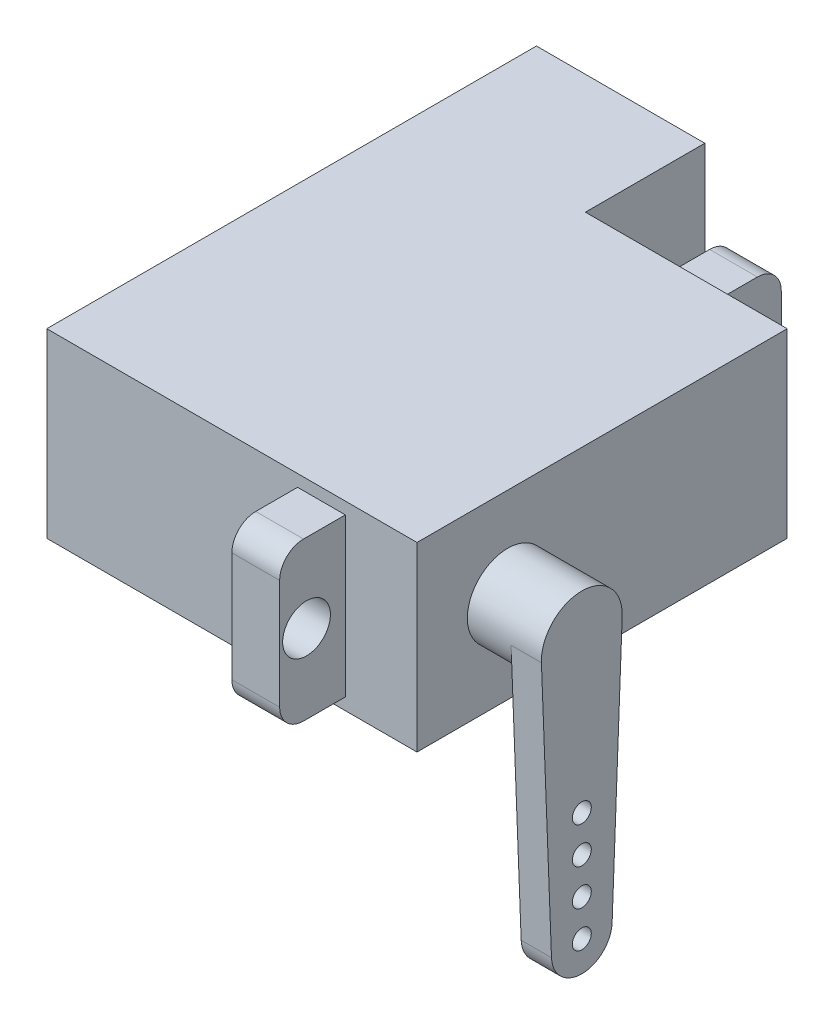
ISO-10303-21;
HEADER;
FILE_DESCRIPTION(('STEP AP214'),'2;1');
FILE_NAME('part.step','',(''),(''),'','','');
FILE_SCHEMA(('AUTOMOTIVE_DESIGN { 1 0 10303 214 1 1 1 1 }'));
ENDSEC;
DATA;
#1=APPLICATION_CONTEXT('core data for automotive mechanical design processes');
#2=APPLICATION_PROTOCOL_DEFINITION('international standard','automotive_design',2000,#1);
#3=PRODUCT_CONTEXT('',#1,'mechanical');
#4=PRODUCT('Part','Part','',(#3));
#5=PRODUCT_RELATED_PRODUCT_CATEGORY('part','',(#4));
#6=PRODUCT_DEFINITION_FORMATION('','',#4);
#7=PRODUCT_DEFINITION_CONTEXT('part definition',#1,'design');
#8=PRODUCT_DEFINITION('design','',#6,#7);
#9=PRODUCT_DEFINITION_SHAPE('','',#8);
#10=(LENGTH_UNIT() NAMED_UNIT(*) SI_UNIT(.MILLI.,.METRE.));
#11=(NAMED_UNIT(*) PLANE_ANGLE_UNIT() SI_UNIT($,.RADIAN.));
#12=(NAMED_UNIT(*) SI_UNIT($,.STERADIAN.) SOLID_ANGLE_UNIT());
#13=UNCERTAINTY_MEASURE_WITH_UNIT(LENGTH_MEASURE(1.E-05),#10,'distance_accuracy_value','');
#14=(GEOMETRIC_REPRESENTATION_CONTEXT(3) GLOBAL_UNCERTAINTY_ASSIGNED_CONTEXT((#13)) GLOBAL_UNIT_ASSIGNED_CONTEXT((#10,
#11,#12)) REPRESENTATION_CONTEXT('',''));
#15=CARTESIAN_POINT('',(0.,0.,0.));
#16=DIRECTION('',(0.,0.,1.));
#17=DIRECTION('',(1.,0.,0.));
#18=AXIS2_PLACEMENT_3D('',#15,#16,#17);
#19=CARTESIAN_POINT('',(31.,-7.6,-15.5));
#20=DIRECTION('',(0.,0.,1.));
#21=DIRECTION('',(1.,0.,0.));
#22=AXIS2_PLACEMENT_3D('',#19,#20,#21);
#23=PLANE('',#22);
#24=DIRECTION('',(0.,-1.,0.));
#25=VECTOR('',#24,1.);
#26=CARTESIAN_POINT('',(25.,-6.6,-15.5));
#27=LINE('',#26,#25);
#28=CARTESIAN_POINT('',(25.,6.6,-15.5));
#29=VERTEX_POINT('',#28);
#30=CARTESIAN_POINT('',(25.,-6.6,-15.5));
#31=VERTEX_POINT('',#30);
#32=EDGE_CURVE('E277',#29,#31,#27,.T.);
#33=ORIENTED_EDGE('',*,*,#32,.F.);
#34=DIRECTION('',(-1.,0.,0.));
#35=VECTOR('',#34,1.);
#36=CARTESIAN_POINT('',(25.,6.6,-15.5));
#37=LINE('',#36,#35);
#38=CARTESIAN_POINT('',(21.,6.6,-15.5));
#39=VERTEX_POINT('',#38);
#40=EDGE_CURVE('E291',#29,#39,#37,.T.);
#41=ORIENTED_EDGE('',*,*,#40,.T.);
#42=DIRECTION('',(0.,-1.,0.));
#43=VECTOR('',#42,1.);
#44=CARTESIAN_POINT('',(21.,-6.6,-15.5));
#45=LINE('',#44,#43);
#46=CARTESIAN_POINT('',(21.,-6.6,-15.5));
#47=VERTEX_POINT('',#46);
#48=EDGE_CURVE('E292',#39,#47,#45,.T.);
#49=ORIENTED_EDGE('',*,*,#48,.T.);
#50=DIRECTION('',(-1.,0.,0.));
#51=VECTOR('',#50,1.);
#52=CARTESIAN_POINT('',(25.,-6.6,-15.5));
#53=LINE('',#52,#51);
#54=EDGE_CURVE('E318',#31,#47,#53,.T.);
#55=ORIENTED_EDGE('',*,*,#54,.F.);
#56=EDGE_LOOP('',(#33,#41,#49,#55));
#57=FACE_BOUND('',#56,.T.);
#58=DIRECTION('',(0.,-1.,0.));
#59=VECTOR('',#58,1.);
#60=CARTESIAN_POINT('',(14.1,-7.6,-15.5));
#61=LINE('',#60,#59);
#62=CARTESIAN_POINT('',(14.1,7.6,-15.5));
#63=VERTEX_POINT('',#62);
#64=CARTESIAN_POINT('',(14.1,-7.6,-15.5));
#65=VERTEX_POINT('',#64);
#66=EDGE_CURVE('E47',#63,#65,#61,.T.);
#67=ORIENTED_EDGE('',*,*,#66,.F.);
#68=DIRECTION('',(-1.,0.,0.));
#69=VECTOR('',#68,1.);
#70=CARTESIAN_POINT('',(31.,7.6,-15.5));
#71=LINE('',#70,#69);
#72=CARTESIAN_POINT('',(31.,7.6,-15.5));
#73=VERTEX_POINT('',#72);
#74=EDGE_CURVE('E380',#73,#63,#71,.T.);
#75=ORIENTED_EDGE('',*,*,#74,.F.);
#76=DIRECTION('',(0.,1.,0.));
#77=VECTOR('',#76,1.);
#78=CARTESIAN_POINT('',(31.,-7.6,-15.5));
#79=LINE('',#78,#77);
#80=CARTESIAN_POINT('',(31.,-7.6,-15.5));
#81=VERTEX_POINT('',#80);
#82=EDGE_CURVE('E362',#81,#73,#79,.T.);
#83=ORIENTED_EDGE('',*,*,#82,.F.);
#84=DIRECTION('',(-1.,0.,0.));
#85=VECTOR('',#84,1.);
#86=CARTESIAN_POINT('',(31.,-7.6,-15.5));
#87=LINE('',#86,#85);
#88=EDGE_CURVE('E52',#81,#65,#87,.T.);
#89=ORIENTED_EDGE('',*,*,#88,.T.);
#90=EDGE_LOOP('',(#67,#75,#83,#89));
#91=FACE_BOUND('',#90,.T.);
#92=ADVANCED_FACE('F33',(#57,#91),#23,.F.);
#93=CARTESIAN_POINT('',(31.,-7.6,15.5));
#94=DIRECTION('',(0.,0.,-1.));
#95=DIRECTION('',(-1.,0.,0.));
#96=AXIS2_PLACEMENT_3D('',#93,#94,#95);
#97=PLANE('',#96);
#98=DIRECTION('',(0.,-1.,0.));
#99=VECTOR('',#98,1.);
#100=CARTESIAN_POINT('',(0.,-7.6,15.5));
#101=LINE('',#100,#99);
#102=CARTESIAN_POINT('',(0.,7.6,15.5));
#103=VERTEX_POINT('',#102);
#104=CARTESIAN_POINT('',(0.,-7.6,15.5));
#105=VERTEX_POINT('',#104);
#106=EDGE_CURVE('E187',#103,#105,#101,.T.);
#107=ORIENTED_EDGE('',*,*,#106,.T.);
#108=DIRECTION('',(-1.,0.,0.));
#109=VECTOR('',#108,1.);
#110=CARTESIAN_POINT('',(31.,-7.6,15.5));
#111=LINE('',#110,#109);
#112=CARTESIAN_POINT('',(31.,-7.6,15.5));
#113=VERTEX_POINT('',#112);
#114=EDGE_CURVE('E375',#113,#105,#111,.T.);
#115=ORIENTED_EDGE('',*,*,#114,.F.);
#116=DIRECTION('',(0.,-1.,0.));
#117=VECTOR('',#116,1.);
#118=CARTESIAN_POINT('',(31.,-7.6,15.5));
#119=LINE('',#118,#117);
#120=CARTESIAN_POINT('',(31.,7.6,15.5));
#121=VERTEX_POINT('',#120);
#122=EDGE_CURVE('E368',#121,#113,#119,.T.);
#123=ORIENTED_EDGE('',*,*,#122,.F.);
#124=DIRECTION('',(-1.,0.,0.));
#125=VECTOR('',#124,1.);
#126=CARTESIAN_POINT('',(31.,7.6,15.5));
#127=LINE('',#126,#125);
#128=EDGE_CURVE('E378',#121,#103,#127,.T.);
#129=ORIENTED_EDGE('',*,*,#128,.T.);
#130=EDGE_LOOP('',(#107,#115,#123,#129));
#131=FACE_BOUND('',#130,.T.);
#132=DIRECTION('',(0.,1.,0.));
#133=VECTOR('',#132,1.);
#134=CARTESIAN_POINT('',(25.,6.6,15.5));
#135=LINE('',#134,#133);
#136=CARTESIAN_POINT('',(25.,-6.6,15.5));
#137=VERTEX_POINT('',#136);
#138=CARTESIAN_POINT('',(25.,6.6,15.5));
#139=VERTEX_POINT('',#138);
#140=EDGE_CURVE('E321',#137,#139,#135,.T.);
#141=ORIENTED_EDGE('',*,*,#140,.F.);
#142=DIRECTION('',(-1.,0.,0.));
#143=VECTOR('',#142,1.);
#144=CARTESIAN_POINT('',(25.,-6.6,15.5));
#145=LINE('',#144,#143);
#146=CARTESIAN_POINT('',(21.,-6.6,15.5));
#147=VERTEX_POINT('',#146);
#148=EDGE_CURVE('E335',#137,#147,#145,.T.);
#149=ORIENTED_EDGE('',*,*,#148,.T.);
#150=DIRECTION('',(0.,1.,0.));
#151=VECTOR('',#150,1.);
#152=CARTESIAN_POINT('',(21.,6.6,15.5));
#153=LINE('',#152,#151);
#154=CARTESIAN_POINT('',(21.,6.6,15.5));
#155=VERTEX_POINT('',#154);
#156=EDGE_CURVE('E320',#147,#155,#153,.T.);
#157=ORIENTED_EDGE('',*,*,#156,.T.);
#158=DIRECTION('',(-1.,0.,0.));
#159=VECTOR('',#158,1.);
#160=CARTESIAN_POINT('',(25.,6.6,15.5));
#161=LINE('',#160,#159);
#162=EDGE_CURVE('E191',#139,#155,#161,.T.);
#163=ORIENTED_EDGE('',*,*,#162,.F.);
#164=EDGE_LOOP('',(#141,#149,#157,#163));
#165=FACE_BOUND('',#164,.T.);
#166=ADVANCED_FACE('F403',(#131,#165),#97,.F.);
#167=CARTESIAN_POINT('',(31.,7.6,15.5));
#168=DIRECTION('',(0.,-1.,0.));
#169=DIRECTION('',(0.,0.,-1.));
#170=AXIS2_PLACEMENT_3D('',#167,#168,#169);
#171=PLANE('',#170);
#172=DIRECTION('',(0.,0.,1.));
#173=VECTOR('',#172,1.);
#174=CARTESIAN_POINT('',(0.,7.6,15.5));
#175=LINE('',#174,#173);
#176=CARTESIAN_POINT('',(0.,7.6,-25.5));
#177=VERTEX_POINT('',#176);
#178=EDGE_CURVE('E181',#177,#103,#175,.T.);
#179=ORIENTED_EDGE('',*,*,#178,.T.);
#180=ORIENTED_EDGE('',*,*,#128,.F.);
#181=DIRECTION('',(0.,0.,1.));
#182=VECTOR('',#181,1.);
#183=CARTESIAN_POINT('',(31.,7.6,15.5));
#184=LINE('',#183,#182);
#185=EDGE_CURVE('E365',#73,#121,#184,.T.);
#186=ORIENTED_EDGE('',*,*,#185,.F.);
#187=ORIENTED_EDGE('',*,*,#74,.T.);
#188=DIRECTION('',(0.,0.,1.));
#189=VECTOR('',#188,1.);
#190=CARTESIAN_POINT('',(14.1,7.6,-25.5));
#191=LINE('',#190,#189);
#192=CARTESIAN_POINT('',(14.1,7.6,-25.5));
#193=VERTEX_POINT('',#192);
#194=EDGE_CURVE('E197',#193,#63,#191,.T.);
#195=ORIENTED_EDGE('',*,*,#194,.F.);
#196=DIRECTION('',(1.,0.,0.));
#197=VECTOR('',#196,1.);
#198=CARTESIAN_POINT('',(0.,7.6,-25.5));
#199=LINE('',#198,#197);
#200=EDGE_CURVE('E194',#177,#193,#199,.T.);
#201=ORIENTED_EDGE('',*,*,#200,.F.);
#202=EDGE_LOOP('',(#179,#180,#186,#187,#195,#201));
#203=FACE_BOUND('',#202,.T.);
#204=ADVANCED_FACE('F195',(#203),#171,.F.);
#205=CARTESIAN_POINT('',(31.,-7.6,15.5));
#206=DIRECTION('',(0.,1.,0.));
#207=DIRECTION('',(0.,0.,1.));
#208=AXIS2_PLACEMENT_3D('',#205,#206,#207);
#209=PLANE('',#208);
#210=DIRECTION('',(0.,0.,-1.));
#211=VECTOR('',#210,1.);
#212=CARTESIAN_POINT('',(0.,-7.6,15.5));
#213=LINE('',#212,#211);
#214=CARTESIAN_POINT('',(0.,-7.6,-25.5));
#215=VERTEX_POINT('',#214);
#216=EDGE_CURVE('E366',#105,#215,#213,.T.);
#217=ORIENTED_EDGE('',*,*,#216,.T.);
#218=DIRECTION('',(-1.,0.,0.));
#219=VECTOR('',#218,1.);
#220=CARTESIAN_POINT('',(0.,-7.6,-25.5));
#221=LINE('',#220,#219);
#222=CARTESIAN_POINT('',(14.1,-7.6,-25.5));
#223=VERTEX_POINT('',#222);
#224=EDGE_CURVE('E205',#223,#215,#221,.T.);
#225=ORIENTED_EDGE('',*,*,#224,.F.);
#226=DIRECTION('',(0.,0.,1.));
#227=VECTOR('',#226,1.);
#228=CARTESIAN_POINT('',(14.1,-7.6,-25.5));
#229=LINE('',#228,#227);
#230=EDGE_CURVE('E210',#223,#65,#229,.T.);
#231=ORIENTED_EDGE('',*,*,#230,.T.);
#232=ORIENTED_EDGE('',*,*,#88,.F.);
#233=DIRECTION('',(0.,0.,-1.));
#234=VECTOR('',#233,1.);
#235=CARTESIAN_POINT('',(31.,-7.6,15.5));
#236=LINE('',#235,#234);
#237=EDGE_CURVE('E370',#113,#81,#236,.T.);
#238=ORIENTED_EDGE('',*,*,#237,.F.);
#239=ORIENTED_EDGE('',*,*,#114,.T.);
#240=EDGE_LOOP('',(#217,#225,#231,#232,#238,#239));
#241=FACE_BOUND('',#240,.T.);
#242=ADVANCED_FACE('F393',(#241),#209,.F.);
#243=CARTESIAN_POINT('',(31.,0.,0.));
#244=DIRECTION('',(-1.,0.,0.));
#245=DIRECTION('',(0.,0.,1.));
#246=AXIS2_PLACEMENT_3D('',#243,#244,#245);
#247=PLANE('',#246);
#248=CARTESIAN_POINT('',(31.,0.,7.9));
#249=DIRECTION('',(-1.,0.,0.));
#250=DIRECTION('',(0.,0.,1.));
#251=AXIS2_PLACEMENT_3D('',#248,#249,#250);
#252=CIRCLE('',#251,3.38413067048743);
#253=CARTESIAN_POINT('',(31.,0.,11.2841306704874));
#254=VERTEX_POINT('',#253);
#255=EDGE_CURVE('E40',#254,#254,#252,.F.);
#256=ORIENTED_EDGE('',*,*,#255,.F.);
#257=EDGE_LOOP('',(#256));
#258=FACE_BOUND('',#257,.T.);
#259=ORIENTED_EDGE('',*,*,#82,.T.);
#260=ORIENTED_EDGE('',*,*,#185,.T.);
#261=ORIENTED_EDGE('',*,*,#122,.T.);
#262=ORIENTED_EDGE('',*,*,#237,.T.);
#263=EDGE_LOOP('',(#259,#260,#261,#262));
#264=FACE_BOUND('',#263,.T.);
#265=ADVANCED_FACE('F390',(#258,#264),#247,.F.);
#266=CARTESIAN_POINT('',(0.,0.,0.));
#267=DIRECTION('',(-1.,0.,0.));
#268=DIRECTION('',(0.,0.,1.));
#269=AXIS2_PLACEMENT_3D('',#266,#267,#268);
#270=PLANE('',#269);
#271=ORIENTED_EDGE('',*,*,#178,.F.);
#272=DIRECTION('',(0.,1.,0.));
#273=VECTOR('',#272,1.);
#274=CARTESIAN_POINT('',(0.,-7.6,-25.5));
#275=LINE('',#274,#273);
#276=EDGE_CURVE('E186',#215,#177,#275,.T.);
#277=ORIENTED_EDGE('',*,*,#276,.F.);
#278=ORIENTED_EDGE('',*,*,#216,.F.);
#279=ORIENTED_EDGE('',*,*,#106,.F.);
#280=EDGE_LOOP('',(#271,#277,#278,#279));
#281=FACE_BOUND('',#280,.T.);
#282=ADVANCED_FACE('F183',(#281),#270,.T.);
#283=CARTESIAN_POINT('',(25.,6.6,15.5));
#284=DIRECTION('',(0.,-1.,0.));
#285=DIRECTION('',(0.,0.,-1.));
#286=AXIS2_PLACEMENT_3D('',#283,#284,#285);
#287=PLANE('',#286);
#288=DIRECTION('',(0.,0.,1.));
#289=VECTOR('',#288,1.);
#290=CARTESIAN_POINT('',(21.,6.6,15.5));
#291=LINE('',#290,#289);
#292=CARTESIAN_POINT('',(21.,6.6,19.));
#293=VERTEX_POINT('',#292);
#294=EDGE_CURVE('E338',#155,#293,#291,.T.);
#295=ORIENTED_EDGE('',*,*,#294,.T.);
#296=DIRECTION('',(-1.,0.,0.));
#297=VECTOR('',#296,1.);
#298=CARTESIAN_POINT('',(25.,6.6,19.));
#299=LINE('',#298,#297);
#300=CARTESIAN_POINT('',(25.,6.6,19.));
#301=VERTEX_POINT('',#300);
#302=EDGE_CURVE('E358',#301,#293,#299,.T.);
#303=ORIENTED_EDGE('',*,*,#302,.F.);
#304=DIRECTION('',(0.,0.,1.));
#305=VECTOR('',#304,1.);
#306=CARTESIAN_POINT('',(25.,6.6,15.5));
#307=LINE('',#306,#305);
#308=EDGE_CURVE('E324',#139,#301,#307,.T.);
#309=ORIENTED_EDGE('',*,*,#308,.F.);
#310=ORIENTED_EDGE('',*,*,#162,.T.);
#311=EDGE_LOOP('',(#295,#303,#309,#310));
#312=FACE_BOUND('',#311,.T.);
#313=ADVANCED_FACE('F427',(#312),#287,.F.);
#314=CARTESIAN_POINT('',(25.,4.6,19.));
#315=DIRECTION('',(-1.,0.,0.));
#316=DIRECTION('',(0.,0.,1.));
#317=AXIS2_PLACEMENT_3D('',#314,#315,#316);
#318=CYLINDRICAL_SURFACE('',#317,2.);
#319=CARTESIAN_POINT('',(21.,4.6,19.));
#320=DIRECTION('',(1.,0.,0.));
#321=DIRECTION('',(0.,0.,-1.));
#322=AXIS2_PLACEMENT_3D('',#319,#320,#321);
#323=CIRCLE('',#322,2.);
#324=CARTESIAN_POINT('',(21.,4.6,21.));
#325=VERTEX_POINT('',#324);
#326=EDGE_CURVE('E340',#293,#325,#323,.T.);
#327=ORIENTED_EDGE('',*,*,#326,.T.);
#328=DIRECTION('',(-1.,0.,0.));
#329=VECTOR('',#328,1.);
#330=CARTESIAN_POINT('',(25.,4.6,21.));
#331=LINE('',#330,#329);
#332=CARTESIAN_POINT('',(25.,4.6,21.));
#333=VERTEX_POINT('',#332);
#334=EDGE_CURVE('E355',#333,#325,#331,.T.);
#335=ORIENTED_EDGE('',*,*,#334,.F.);
#336=CARTESIAN_POINT('',(25.,4.6,19.));
#337=DIRECTION('',(1.,0.,0.));
#338=DIRECTION('',(0.,0.,-1.));
#339=AXIS2_PLACEMENT_3D('',#336,#337,#338);
#340=CIRCLE('',#339,2.);
#341=EDGE_CURVE('E327',#301,#333,#340,.T.);
#342=ORIENTED_EDGE('',*,*,#341,.F.);
#343=ORIENTED_EDGE('',*,*,#302,.T.);
#344=EDGE_LOOP('',(#327,#335,#342,#343));
#345=FACE_BOUND('',#344,.T.);
#346=ADVANCED_FACE('F430',(#345),#318,.T.);
#347=CARTESIAN_POINT('',(25.,4.6,21.));
#348=DIRECTION('',(0.,0.,-1.));
#349=DIRECTION('',(-1.,0.,0.));
#350=AXIS2_PLACEMENT_3D('',#347,#348,#349);
#351=PLANE('',#350);
#352=DIRECTION('',(0.,-1.,0.));
#353=VECTOR('',#352,1.);
#354=CARTESIAN_POINT('',(21.,4.6,21.));
#355=LINE('',#354,#353);
#356=CARTESIAN_POINT('',(21.,-4.6,21.));
#357=VERTEX_POINT('',#356);
#358=EDGE_CURVE('E342',#325,#357,#355,.T.);
#359=ORIENTED_EDGE('',*,*,#358,.T.);
#360=DIRECTION('',(-1.,0.,0.));
#361=VECTOR('',#360,1.);
#362=CARTESIAN_POINT('',(25.,-4.6,21.));
#363=LINE('',#362,#361);
#364=CARTESIAN_POINT('',(25.,-4.6,21.));
#365=VERTEX_POINT('',#364);
#366=EDGE_CURVE('E352',#365,#357,#363,.T.);
#367=ORIENTED_EDGE('',*,*,#366,.F.);
#368=DIRECTION('',(0.,-1.,0.));
#369=VECTOR('',#368,1.);
#370=CARTESIAN_POINT('',(25.,4.6,21.));
#371=LINE('',#370,#369);
#372=EDGE_CURVE('E329',#333,#365,#371,.T.);
#373=ORIENTED_EDGE('',*,*,#372,.F.);
#374=ORIENTED_EDGE('',*,*,#334,.T.);
#375=EDGE_LOOP('',(#359,#367,#373,#374));
#376=FACE_BOUND('',#375,.T.);
#377=ADVANCED_FACE('F435',(#376),#351,.F.);
#378=CARTESIAN_POINT('',(25.,-4.6,19.));
#379=DIRECTION('',(-1.,0.,0.));
#380=DIRECTION('',(0.,0.,1.));
#381=AXIS2_PLACEMENT_3D('',#378,#379,#380);
#382=CYLINDRICAL_SURFACE('',#381,2.);
#383=CARTESIAN_POINT('',(21.,-4.6,19.));
#384=DIRECTION('',(1.,0.,0.));
#385=DIRECTION('',(0.,0.,1.));
#386=AXIS2_PLACEMENT_3D('',#383,#384,#385);
#387=CIRCLE('',#386,2.);
#388=CARTESIAN_POINT('',(21.,-6.6,19.));
#389=VERTEX_POINT('',#388);
#390=EDGE_CURVE('E344',#357,#389,#387,.T.);
#391=ORIENTED_EDGE('',*,*,#390,.T.);
#392=DIRECTION('',(-1.,0.,0.));
#393=VECTOR('',#392,1.);
#394=CARTESIAN_POINT('',(25.,-6.6,19.));
#395=LINE('',#394,#393);
#396=CARTESIAN_POINT('',(25.,-6.6,19.));
#397=VERTEX_POINT('',#396);
#398=EDGE_CURVE('E349',#397,#389,#395,.T.);
#399=ORIENTED_EDGE('',*,*,#398,.F.);
#400=CARTESIAN_POINT('',(25.,-4.6,19.));
#401=DIRECTION('',(1.,0.,0.));
#402=DIRECTION('',(0.,0.,1.));
#403=AXIS2_PLACEMENT_3D('',#400,#401,#402);
#404=CIRCLE('',#403,2.);
#405=EDGE_CURVE('E331',#365,#397,#404,.T.);
#406=ORIENTED_EDGE('',*,*,#405,.F.);
#407=ORIENTED_EDGE('',*,*,#366,.T.);
#408=EDGE_LOOP('',(#391,#399,#406,#407));
#409=FACE_BOUND('',#408,.T.);
#410=ADVANCED_FACE('F437',(#409),#382,.T.);
#411=CARTESIAN_POINT('',(25.,-6.6,15.5));
#412=DIRECTION('',(0.,1.,0.));
#413=DIRECTION('',(0.,0.,1.));
#414=AXIS2_PLACEMENT_3D('',#411,#412,#413);
#415=PLANE('',#414);
#416=DIRECTION('',(0.,0.,-1.));
#417=VECTOR('',#416,1.);
#418=CARTESIAN_POINT('',(21.,-6.6,15.5));
#419=LINE('',#418,#417);
#420=EDGE_CURVE('E325',#389,#147,#419,.T.);
#421=ORIENTED_EDGE('',*,*,#420,.T.);
#422=ORIENTED_EDGE('',*,*,#148,.F.);
#423=DIRECTION('',(0.,0.,-1.));
#424=VECTOR('',#423,1.);
#425=CARTESIAN_POINT('',(25.,-6.6,15.5));
#426=LINE('',#425,#424);
#427=EDGE_CURVE('E333',#397,#137,#426,.T.);
#428=ORIENTED_EDGE('',*,*,#427,.F.);
#429=ORIENTED_EDGE('',*,*,#398,.T.);
#430=EDGE_LOOP('',(#421,#422,#428,#429));
#431=FACE_BOUND('',#430,.T.);
#432=ADVANCED_FACE('F417',(#431),#415,.F.);
#433=CARTESIAN_POINT('',(25.,-4.6,19.));
#434=DIRECTION('',(-1.,0.,0.));
#435=DIRECTION('',(0.,0.,1.));
#436=AXIS2_PLACEMENT_3D('',#433,#434,#435);
#437=PLANE('',#436);
#438=CARTESIAN_POINT('',(25.,0.,18.75));
#439=DIRECTION('',(1.,0.,0.));
#440=DIRECTION('',(0.,0.,-1.));
#441=AXIS2_PLACEMENT_3D('',#438,#439,#440);
#442=CIRCLE('',#441,2.);
#443=CARTESIAN_POINT('',(25.,0.,16.75));
#444=VERTEX_POINT('',#443);
#445=EDGE_CURVE('E269',#444,#444,#442,.T.);
#446=ORIENTED_EDGE('',*,*,#445,.F.);
#447=EDGE_LOOP('',(#446));
#448=FACE_BOUND('',#447,.T.);
#449=ORIENTED_EDGE('',*,*,#140,.T.);
#450=ORIENTED_EDGE('',*,*,#308,.T.);
#451=ORIENTED_EDGE('',*,*,#341,.T.);
#452=ORIENTED_EDGE('',*,*,#372,.T.);
#453=ORIENTED_EDGE('',*,*,#405,.T.);
#454=ORIENTED_EDGE('',*,*,#427,.T.);
#455=EDGE_LOOP('',(#449,#450,#451,#452,#453,#454));
#456=FACE_BOUND('',#455,.T.);
#457=ADVANCED_FACE('F411',(#448,#456),#437,.F.);
#458=CARTESIAN_POINT('',(21.,-4.6,19.));
#459=DIRECTION('',(-1.,0.,0.));
#460=DIRECTION('',(0.,0.,1.));
#461=AXIS2_PLACEMENT_3D('',#458,#459,#460);
#462=PLANE('',#461);
#463=CARTESIAN_POINT('',(21.,0.,18.75));
#464=DIRECTION('',(-1.,0.,0.));
#465=DIRECTION('',(0.,0.,1.));
#466=AXIS2_PLACEMENT_3D('',#463,#464,#465);
#467=CIRCLE('',#466,2.);
#468=CARTESIAN_POINT('',(21.,0.,20.75));
#469=VERTEX_POINT('',#468);
#470=EDGE_CURVE('E272',#469,#469,#467,.T.);
#471=ORIENTED_EDGE('',*,*,#470,.F.);
#472=EDGE_LOOP('',(#471));
#473=FACE_BOUND('',#472,.T.);
#474=ORIENTED_EDGE('',*,*,#156,.F.);
#475=ORIENTED_EDGE('',*,*,#420,.F.);
#476=ORIENTED_EDGE('',*,*,#390,.F.);
#477=ORIENTED_EDGE('',*,*,#358,.F.);
#478=ORIENTED_EDGE('',*,*,#326,.F.);
#479=ORIENTED_EDGE('',*,*,#294,.F.);
#480=EDGE_LOOP('',(#474,#475,#476,#477,#478,#479));
#481=FACE_BOUND('',#480,.T.);
#482=ADVANCED_FACE('F423',(#473,#481),#462,.T.);
#483=CARTESIAN_POINT('',(25.,-6.6,-15.5));
#484=DIRECTION('',(0.,1.,0.));
#485=DIRECTION('',(0.,0.,1.));
#486=AXIS2_PLACEMENT_3D('',#483,#484,#485);
#487=PLANE('',#486);
#488=DIRECTION('',(0.,0.,-1.));
#489=VECTOR('',#488,1.);
#490=CARTESIAN_POINT('',(21.,-6.6,-15.5));
#491=LINE('',#490,#489);
#492=CARTESIAN_POINT('',(21.,-6.6,-19.));
#493=VERTEX_POINT('',#492);
#494=EDGE_CURVE('E295',#47,#493,#491,.T.);
#495=ORIENTED_EDGE('',*,*,#494,.T.);
#496=DIRECTION('',(-1.,0.,0.));
#497=VECTOR('',#496,1.);
#498=CARTESIAN_POINT('',(25.,-6.6,-19.));
#499=LINE('',#498,#497);
#500=CARTESIAN_POINT('',(25.,-6.6,-19.));
#501=VERTEX_POINT('',#500);
#502=EDGE_CURVE('E315',#501,#493,#499,.T.);
#503=ORIENTED_EDGE('',*,*,#502,.F.);
#504=DIRECTION('',(0.,0.,-1.));
#505=VECTOR('',#504,1.);
#506=CARTESIAN_POINT('',(25.,-6.6,-15.5));
#507=LINE('',#506,#505);
#508=EDGE_CURVE('E280',#31,#501,#507,.T.);
#509=ORIENTED_EDGE('',*,*,#508,.F.);
#510=ORIENTED_EDGE('',*,*,#54,.T.);
#511=EDGE_LOOP('',(#495,#503,#509,#510));
#512=FACE_BOUND('',#511,.T.);
#513=ADVANCED_FACE('F470',(#512),#487,.F.);
#514=CARTESIAN_POINT('',(25.,-4.6,-19.));
#515=DIRECTION('',(-1.,0.,0.));
#516=DIRECTION('',(0.,0.,1.));
#517=AXIS2_PLACEMENT_3D('',#514,#515,#516);
#518=CYLINDRICAL_SURFACE('',#517,2.);
#519=CARTESIAN_POINT('',(21.,-4.6,-19.));
#520=DIRECTION('',(1.,0.,0.));
#521=DIRECTION('',(0.,0.,-1.));
#522=AXIS2_PLACEMENT_3D('',#519,#520,#521);
#523=CIRCLE('',#522,2.);
#524=CARTESIAN_POINT('',(21.,-4.6,-21.));
#525=VERTEX_POINT('',#524);
#526=EDGE_CURVE('E297',#493,#525,#523,.T.);
#527=ORIENTED_EDGE('',*,*,#526,.T.);
#528=DIRECTION('',(-1.,0.,0.));
#529=VECTOR('',#528,1.);
#530=CARTESIAN_POINT('',(25.,-4.6,-21.));
#531=LINE('',#530,#529);
#532=CARTESIAN_POINT('',(25.,-4.6,-21.));
#533=VERTEX_POINT('',#532);
#534=EDGE_CURVE('E312',#533,#525,#531,.T.);
#535=ORIENTED_EDGE('',*,*,#534,.F.);
#536=CARTESIAN_POINT('',(25.,-4.6,-19.));
#537=DIRECTION('',(1.,0.,0.));
#538=DIRECTION('',(0.,0.,-1.));
#539=AXIS2_PLACEMENT_3D('',#536,#537,#538);
#540=CIRCLE('',#539,2.);
#541=EDGE_CURVE('E283',#501,#533,#540,.T.);
#542=ORIENTED_EDGE('',*,*,#541,.F.);
#543=ORIENTED_EDGE('',*,*,#502,.T.);
#544=EDGE_LOOP('',(#527,#535,#542,#543));
#545=FACE_BOUND('',#544,.T.);
#546=ADVANCED_FACE('F473',(#545),#518,.T.);
#547=CARTESIAN_POINT('',(25.,-4.6,-21.));
#548=DIRECTION('',(0.,0.,1.));
#549=DIRECTION('',(1.,0.,0.));
#550=AXIS2_PLACEMENT_3D('',#547,#548,#549);
#551=PLANE('',#550);
#552=DIRECTION('',(0.,1.,0.));
#553=VECTOR('',#552,1.);
#554=CARTESIAN_POINT('',(21.,-4.6,-21.));
#555=LINE('',#554,#553);
#556=CARTESIAN_POINT('',(21.,4.6,-21.));
#557=VERTEX_POINT('',#556);
#558=EDGE_CURVE('E299',#525,#557,#555,.T.);
#559=ORIENTED_EDGE('',*,*,#558,.T.);
#560=DIRECTION('',(-1.,0.,0.));
#561=VECTOR('',#560,1.);
#562=CARTESIAN_POINT('',(25.,4.6,-21.));
#563=LINE('',#562,#561);
#564=CARTESIAN_POINT('',(25.,4.6,-21.));
#565=VERTEX_POINT('',#564);
#566=EDGE_CURVE('E309',#565,#557,#563,.T.);
#567=ORIENTED_EDGE('',*,*,#566,.F.);
#568=DIRECTION('',(0.,1.,0.));
#569=VECTOR('',#568,1.);
#570=CARTESIAN_POINT('',(25.,-4.6,-21.));
#571=LINE('',#570,#569);
#572=EDGE_CURVE('E285',#533,#565,#571,.T.);
#573=ORIENTED_EDGE('',*,*,#572,.F.);
#574=ORIENTED_EDGE('',*,*,#534,.T.);
#575=EDGE_LOOP('',(#559,#567,#573,#574));
#576=FACE_BOUND('',#575,.T.);
#577=ADVANCED_FACE('F478',(#576),#551,.F.);
#578=CARTESIAN_POINT('',(25.,4.6,-19.));
#579=DIRECTION('',(-1.,0.,0.));
#580=DIRECTION('',(0.,0.,1.));
#581=AXIS2_PLACEMENT_3D('',#578,#579,#580);
#582=CYLINDRICAL_SURFACE('',#581,2.);
#583=CARTESIAN_POINT('',(21.,4.6,-19.));
#584=DIRECTION('',(1.,0.,0.));
#585=DIRECTION('',(0.,0.,1.));
#586=AXIS2_PLACEMENT_3D('',#583,#584,#585);
#587=CIRCLE('',#586,2.);
#588=CARTESIAN_POINT('',(21.,6.6,-19.));
#589=VERTEX_POINT('',#588);
#590=EDGE_CURVE('E301',#557,#589,#587,.T.);
#591=ORIENTED_EDGE('',*,*,#590,.T.);
#592=DIRECTION('',(-1.,0.,0.));
#593=VECTOR('',#592,1.);
#594=CARTESIAN_POINT('',(25.,6.6,-19.));
#595=LINE('',#594,#593);
#596=CARTESIAN_POINT('',(25.,6.6,-19.));
#597=VERTEX_POINT('',#596);
#598=EDGE_CURVE('E306',#597,#589,#595,.T.);
#599=ORIENTED_EDGE('',*,*,#598,.F.);
#600=CARTESIAN_POINT('',(25.,4.6,-19.));
#601=DIRECTION('',(1.,0.,0.));
#602=DIRECTION('',(0.,0.,1.));
#603=AXIS2_PLACEMENT_3D('',#600,#601,#602);
#604=CIRCLE('',#603,2.);
#605=EDGE_CURVE('E287',#565,#597,#604,.T.);
#606=ORIENTED_EDGE('',*,*,#605,.F.);
#607=ORIENTED_EDGE('',*,*,#566,.T.);
#608=EDGE_LOOP('',(#591,#599,#606,#607));
#609=FACE_BOUND('',#608,.T.);
#610=ADVANCED_FACE('F480',(#609),#582,.T.);
#611=CARTESIAN_POINT('',(25.,6.6,-15.5));
#612=DIRECTION('',(0.,-1.,0.));
#613=DIRECTION('',(0.,0.,-1.));
#614=AXIS2_PLACEMENT_3D('',#611,#612,#613);
#615=PLANE('',#614);
#616=DIRECTION('',(0.,0.,1.));
#617=VECTOR('',#616,1.);
#618=CARTESIAN_POINT('',(21.,6.6,-15.5));
#619=LINE('',#618,#617);
#620=EDGE_CURVE('E281',#589,#39,#619,.T.);
#621=ORIENTED_EDGE('',*,*,#620,.T.);
#622=ORIENTED_EDGE('',*,*,#40,.F.);
#623=DIRECTION('',(0.,0.,1.));
#624=VECTOR('',#623,1.);
#625=CARTESIAN_POINT('',(25.,6.6,-15.5));
#626=LINE('',#625,#624);
#627=EDGE_CURVE('E289',#597,#29,#626,.T.);
#628=ORIENTED_EDGE('',*,*,#627,.F.);
#629=ORIENTED_EDGE('',*,*,#598,.T.);
#630=EDGE_LOOP('',(#621,#622,#628,#629));
#631=FACE_BOUND('',#630,.T.);
#632=ADVANCED_FACE('F460',(#631),#615,.F.);
#633=CARTESIAN_POINT('',(25.,4.6,-19.));
#634=DIRECTION('',(-1.,0.,0.));
#635=DIRECTION('',(0.,0.,1.));
#636=AXIS2_PLACEMENT_3D('',#633,#634,#635);
#637=PLANE('',#636);
#638=CARTESIAN_POINT('',(25.,0.,-18.75));
#639=DIRECTION('',(1.,0.,0.));
#640=DIRECTION('',(0.,0.,-1.));
#641=AXIS2_PLACEMENT_3D('',#638,#639,#640);
#642=CIRCLE('',#641,2.);
#643=CARTESIAN_POINT('',(25.,0.,-20.75));
#644=VERTEX_POINT('',#643);
#645=EDGE_CURVE('E273',#644,#644,#642,.T.);
#646=ORIENTED_EDGE('',*,*,#645,.F.);
#647=EDGE_LOOP('',(#646));
#648=FACE_BOUND('',#647,.T.);
#649=ORIENTED_EDGE('',*,*,#32,.T.);
#650=ORIENTED_EDGE('',*,*,#508,.T.);
#651=ORIENTED_EDGE('',*,*,#541,.T.);
#652=ORIENTED_EDGE('',*,*,#572,.T.);
#653=ORIENTED_EDGE('',*,*,#605,.T.);
#654=ORIENTED_EDGE('',*,*,#627,.T.);
#655=EDGE_LOOP('',(#649,#650,#651,#652,#653,#654));
#656=FACE_BOUND('',#655,.T.);
#657=ADVANCED_FACE('F454',(#648,#656),#637,.F.);
#658=CARTESIAN_POINT('',(21.,4.6,-19.));
#659=DIRECTION('',(-1.,0.,0.));
#660=DIRECTION('',(0.,0.,1.));
#661=AXIS2_PLACEMENT_3D('',#658,#659,#660);
#662=PLANE('',#661);
#663=CARTESIAN_POINT('',(21.,0.,-18.75));
#664=DIRECTION('',(-1.,0.,0.));
#665=DIRECTION('',(0.,0.,1.));
#666=AXIS2_PLACEMENT_3D('',#663,#664,#665);
#667=CIRCLE('',#666,2.);
#668=CARTESIAN_POINT('',(21.,0.,-16.75));
#669=VERTEX_POINT('',#668);
#670=EDGE_CURVE('E276',#669,#669,#667,.T.);
#671=ORIENTED_EDGE('',*,*,#670,.F.);
#672=EDGE_LOOP('',(#671));
#673=FACE_BOUND('',#672,.T.);
#674=ORIENTED_EDGE('',*,*,#48,.F.);
#675=ORIENTED_EDGE('',*,*,#620,.F.);
#676=ORIENTED_EDGE('',*,*,#590,.F.);
#677=ORIENTED_EDGE('',*,*,#558,.F.);
#678=ORIENTED_EDGE('',*,*,#526,.F.);
#679=ORIENTED_EDGE('',*,*,#494,.F.);
#680=EDGE_LOOP('',(#674,#675,#676,#677,#678,#679));
#681=FACE_BOUND('',#680,.T.);
#682=ADVANCED_FACE('F466',(#673,#681),#662,.T.);
#683=CARTESIAN_POINT('',(25.,0.,-18.75));
#684=DIRECTION('',(1.,0.,0.));
#685=DIRECTION('',(0.,0.,-1.));
#686=AXIS2_PLACEMENT_3D('',#683,#684,#685);
#687=CYLINDRICAL_SURFACE('',#686,2.);
#688=ORIENTED_EDGE('',*,*,#670,.T.);
#689=EDGE_LOOP('',(#688));
#690=FACE_BOUND('',#689,.T.);
#691=ORIENTED_EDGE('',*,*,#645,.T.);
#692=EDGE_LOOP('',(#691));
#693=FACE_BOUND('',#692,.T.);
#694=ADVANCED_FACE('F507',(#690,#693),#687,.F.);
#695=CARTESIAN_POINT('',(25.,0.,18.75));
#696=DIRECTION('',(1.,0.,0.));
#697=DIRECTION('',(0.,0.,-1.));
#698=AXIS2_PLACEMENT_3D('',#695,#696,#697);
#699=CYLINDRICAL_SURFACE('',#698,2.);
#700=ORIENTED_EDGE('',*,*,#470,.T.);
#701=EDGE_LOOP('',(#700));
#702=FACE_BOUND('',#701,.T.);
#703=ORIENTED_EDGE('',*,*,#445,.T.);
#704=EDGE_LOOP('',(#703));
#705=FACE_BOUND('',#704,.T.);
#706=ADVANCED_FACE('F504',(#702,#705),#699,.F.);
#707=CARTESIAN_POINT('',(37.2,0.,7.9));
#708=DIRECTION('',(-1.,0.,0.));
#709=DIRECTION('',(0.,0.,1.));
#710=AXIS2_PLACEMENT_3D('',#707,#708,#709);
#711=CYLINDRICAL_SURFACE('',#710,3.38413067048743);
#712=CARTESIAN_POINT('',(34.66,0.,7.9));
#713=DIRECTION('',(-1.,0.,0.));
#714=DIRECTION('',(0.,0.,1.));
#715=AXIS2_PLACEMENT_3D('',#712,#713,#714);
#716=CIRCLE('',#715,3.38413067048743);
#717=CARTESIAN_POINT('',(34.66,-0.13077497216149,4.5183970810295));
#718=VERTEX_POINT('',#717);
#719=CARTESIAN_POINT('',(34.66,-0.130774972161491,11.2816029189705));
#720=VERTEX_POINT('',#719);
#721=EDGE_CURVE('E11',#718,#720,#716,.T.);
#722=ORIENTED_EDGE('',*,*,#721,.T.);
#723=DIRECTION('',(1.,0.,0.));
#724=VECTOR('',#723,1.);
#725=CARTESIAN_POINT('',(34.66,-0.130774972161491,11.2816029189705));
#726=LINE('',#725,#724);
#727=CARTESIAN_POINT('',(37.2,-0.130774972161491,11.2816029189705));
#728=VERTEX_POINT('',#727);
#729=EDGE_CURVE('E250',#720,#728,#726,.T.);
#730=ORIENTED_EDGE('',*,*,#729,.T.);
#731=CARTESIAN_POINT('',(37.2,0.,7.9));
#732=DIRECTION('',(1.,0.,0.));
#733=DIRECTION('',(0.,0.,-1.));
#734=AXIS2_PLACEMENT_3D('',#731,#732,#733);
#735=CIRCLE('',#734,3.38413067048743);
#736=CARTESIAN_POINT('',(37.2,-0.130774972161491,4.5183970810295));
#737=VERTEX_POINT('',#736);
#738=EDGE_CURVE('E260',#737,#728,#735,.T.);
#739=ORIENTED_EDGE('',*,*,#738,.F.);
#740=DIRECTION('',(1.,0.,0.));
#741=VECTOR('',#740,1.);
#742=CARTESIAN_POINT('',(34.66,-0.13077497216149,4.5183970810295));
#743=LINE('',#742,#741);
#744=EDGE_CURVE('E257',#718,#737,#743,.T.);
#745=ORIENTED_EDGE('',*,*,#744,.F.);
#746=EDGE_LOOP('',(#722,#730,#739,#745));
#747=FACE_BOUND('',#746,.T.);
#748=ORIENTED_EDGE('',*,*,#255,.T.);
#749=EDGE_LOOP('',(#748));
#750=FACE_BOUND('',#749,.T.);
#751=ADVANCED_FACE('F388',(#747,#750),#711,.T.);
#752=CARTESIAN_POINT('',(37.2,0.,7.9));
#753=DIRECTION('',(1.,0.,0.));
#754=DIRECTION('',(0.,0.,-1.));
#755=AXIS2_PLACEMENT_3D('',#752,#753,#754);
#756=PLANE('',#755);
#757=CARTESIAN_POINT('',(37.2,-12.7,7.9));
#758=DIRECTION('',(1.,0.,0.));
#759=DIRECTION('',(0.,0.,-1.));
#760=AXIS2_PLACEMENT_3D('',#757,#758,#759);
#761=CIRCLE('',#760,0.793749999999987);
#762=CARTESIAN_POINT('',(37.2,-12.7,7.10625000000001));
#763=VERTEX_POINT('',#762);
#764=EDGE_CURVE('E215',#763,#763,#761,.T.);
#765=ORIENTED_EDGE('',*,*,#764,.F.);
#766=EDGE_LOOP('',(#765));
#767=FACE_BOUND('',#766,.T.);
#768=CARTESIAN_POINT('',(37.2,-15.748,7.89999999999999));
#769=DIRECTION('',(1.,0.,0.));
#770=DIRECTION('',(0.,0.,-1.));
#771=AXIS2_PLACEMENT_3D('',#768,#769,#770);
#772=CIRCLE('',#771,0.793749999999987);
#773=CARTESIAN_POINT('',(37.2,-15.748,7.10625000000001));
#774=VERTEX_POINT('',#773);
#775=EDGE_CURVE('E221',#774,#774,#772,.T.);
#776=ORIENTED_EDGE('',*,*,#775,.F.);
#777=EDGE_LOOP('',(#776));
#778=FACE_BOUND('',#777,.T.);
#779=CARTESIAN_POINT('',(37.2,-18.796,7.89999999999999));
#780=DIRECTION('',(1.,0.,0.));
#781=DIRECTION('',(0.,0.,-1.));
#782=AXIS2_PLACEMENT_3D('',#779,#780,#781);
#783=CIRCLE('',#782,0.793749999999989);
#784=CARTESIAN_POINT('',(37.2,-18.796,7.10625));
#785=VERTEX_POINT('',#784);
#786=EDGE_CURVE('E227',#785,#785,#783,.T.);
#787=ORIENTED_EDGE('',*,*,#786,.F.);
#788=EDGE_LOOP('',(#787));
#789=FACE_BOUND('',#788,.T.);
#790=CARTESIAN_POINT('',(37.2,-21.844,7.89999999999999));
#791=DIRECTION('',(1.,0.,0.));
#792=DIRECTION('',(0.,0.,-1.));
#793=AXIS2_PLACEMENT_3D('',#790,#791,#792);
#794=CIRCLE('',#793,0.793749999999989);
#795=CARTESIAN_POINT('',(37.2,-21.844,7.10625));
#796=VERTEX_POINT('',#795);
#797=EDGE_CURVE('E233',#796,#796,#794,.T.);
#798=ORIENTED_EDGE('',*,*,#797,.F.);
#799=EDGE_LOOP('',(#798));
#800=FACE_BOUND('',#799,.T.);
#801=ORIENTED_EDGE('',*,*,#738,.T.);
#802=DIRECTION('',(0.,-0.999253057354148,-0.0386435941442698));
#803=VECTOR('',#802,1.);
#804=CARTESIAN_POINT('',(37.2,-21.9421547291264,10.4381027656795));
#805=LINE('',#804,#803);
#806=CARTESIAN_POINT('',(37.2,-21.9421547291264,10.4381027656795));
#807=VERTEX_POINT('',#806);
#808=EDGE_CURVE('E239',#728,#807,#805,.T.);
#809=ORIENTED_EDGE('',*,*,#808,.T.);
#810=CARTESIAN_POINT('',(37.2,-21.844,7.9));
#811=DIRECTION('',(1.,0.,0.));
#812=DIRECTION('',(0.,0.,1.));
#813=AXIS2_PLACEMENT_3D('',#810,#811,#812);
#814=CIRCLE('',#813,2.54);
#815=CARTESIAN_POINT('',(37.2,-21.9421547291264,5.36189723432046));
#816=VERTEX_POINT('',#815);
#817=EDGE_CURVE('E253',#807,#816,#814,.T.);
#818=ORIENTED_EDGE('',*,*,#817,.T.);
#819=DIRECTION('',(0.,0.999253057354148,-0.0386435941442695));
#820=VECTOR('',#819,1.);
#821=CARTESIAN_POINT('',(37.2,-0.13077497216149,4.5183970810295));
#822=LINE('',#821,#820);
#823=EDGE_CURVE('E244',#816,#737,#822,.T.);
#824=ORIENTED_EDGE('',*,*,#823,.T.);
#825=EDGE_LOOP('',(#801,#809,#818,#824));
#826=FACE_BOUND('',#825,.T.);
#827=ADVANCED_FACE('F514',(#767,#778,#789,#800,#826),#756,.T.);
#828=CARTESIAN_POINT('',(34.66,0.,7.9));
#829=DIRECTION('',(-1.,0.,0.));
#830=DIRECTION('',(0.,0.,1.));
#831=AXIS2_PLACEMENT_3D('',#828,#829,#830);
#832=PLANE('',#831);
#833=CARTESIAN_POINT('',(34.66,-12.7,7.9));
#834=DIRECTION('',(-1.,0.,0.));
#835=DIRECTION('',(0.,0.,1.));
#836=AXIS2_PLACEMENT_3D('',#833,#834,#835);
#837=CIRCLE('',#836,0.793749999999993);
#838=CARTESIAN_POINT('',(34.66,-12.7,8.69374999999999));
#839=VERTEX_POINT('',#838);
#840=EDGE_CURVE('E218',#839,#839,#837,.T.);
#841=ORIENTED_EDGE('',*,*,#840,.F.);
#842=EDGE_LOOP('',(#841));
#843=FACE_BOUND('',#842,.T.);
#844=CARTESIAN_POINT('',(34.66,-15.748,7.89999999999999));
#845=DIRECTION('',(-1.,0.,0.));
#846=DIRECTION('',(0.,0.,1.));
#847=AXIS2_PLACEMENT_3D('',#844,#845,#846);
#848=CIRCLE('',#847,0.793749999999993);
#849=CARTESIAN_POINT('',(34.66,-15.748,8.69374999999999));
#850=VERTEX_POINT('',#849);
#851=EDGE_CURVE('E224',#850,#850,#848,.T.);
#852=ORIENTED_EDGE('',*,*,#851,.F.);
#853=EDGE_LOOP('',(#852));
#854=FACE_BOUND('',#853,.T.);
#855=CARTESIAN_POINT('',(34.66,-18.796,7.89999999999999));
#856=DIRECTION('',(-1.,0.,0.));
#857=DIRECTION('',(0.,0.,1.));
#858=AXIS2_PLACEMENT_3D('',#855,#856,#857);
#859=CIRCLE('',#858,0.793749999999994);
#860=CARTESIAN_POINT('',(34.66,-18.796,8.69374999999999));
#861=VERTEX_POINT('',#860);
#862=EDGE_CURVE('E230',#861,#861,#859,.T.);
#863=ORIENTED_EDGE('',*,*,#862,.F.);
#864=EDGE_LOOP('',(#863));
#865=FACE_BOUND('',#864,.T.);
#866=CARTESIAN_POINT('',(34.66,-21.844,7.89999999999999));
#867=DIRECTION('',(-1.,0.,0.));
#868=DIRECTION('',(0.,0.,1.));
#869=AXIS2_PLACEMENT_3D('',#866,#867,#868);
#870=CIRCLE('',#869,0.793749999999994);
#871=CARTESIAN_POINT('',(34.66,-21.844,8.69374999999999));
#872=VERTEX_POINT('',#871);
#873=EDGE_CURVE('E236',#872,#872,#870,.T.);
#874=ORIENTED_EDGE('',*,*,#873,.F.);
#875=EDGE_LOOP('',(#874));
#876=FACE_BOUND('',#875,.T.);
#877=ORIENTED_EDGE('',*,*,#721,.F.);
#878=DIRECTION('',(0.,0.999253057354148,-0.0386435941442695));
#879=VECTOR('',#878,1.);
#880=CARTESIAN_POINT('',(34.66,-0.13077497216149,4.5183970810295));
#881=LINE('',#880,#879);
#882=CARTESIAN_POINT('',(34.66,-21.9421547291264,5.36189723432046));
#883=VERTEX_POINT('',#882);
#884=EDGE_CURVE('E247',#883,#718,#881,.T.);
#885=ORIENTED_EDGE('',*,*,#884,.F.);
#886=CARTESIAN_POINT('',(34.66,-21.844,7.9));
#887=DIRECTION('',(1.,0.,0.));
#888=DIRECTION('',(0.,0.,1.));
#889=AXIS2_PLACEMENT_3D('',#886,#887,#888);
#890=CIRCLE('',#889,2.54);
#891=CARTESIAN_POINT('',(34.66,-21.9421547291264,10.4381027656795));
#892=VERTEX_POINT('',#891);
#893=EDGE_CURVE('E243',#892,#883,#890,.T.);
#894=ORIENTED_EDGE('',*,*,#893,.F.);
#895=DIRECTION('',(0.,-0.999253057354148,-0.0386435941442698));
#896=VECTOR('',#895,1.);
#897=CARTESIAN_POINT('',(34.66,-21.9421547291264,10.4381027656795));
#898=LINE('',#897,#896);
#899=EDGE_CURVE('E240',#720,#892,#898,.T.);
#900=ORIENTED_EDGE('',*,*,#899,.F.);
#901=EDGE_LOOP('',(#877,#885,#894,#900));
#902=FACE_BOUND('',#901,.T.);
#903=ADVANCED_FACE('F569',(#843,#854,#865,#876,#902),#832,.T.);
#904=CARTESIAN_POINT('',(34.66,-0.13077497216149,4.5183970810295));
#905=DIRECTION('',(0.,-0.0386435941442695,-0.999253057354148));
#906=DIRECTION('',(0.,0.999253057354148,-0.0386435941442695));
#907=AXIS2_PLACEMENT_3D('',#904,#905,#906);
#908=PLANE('',#907);
#909=ORIENTED_EDGE('',*,*,#823,.F.);
#910=DIRECTION('',(1.,0.,0.));
#911=VECTOR('',#910,1.);
#912=CARTESIAN_POINT('',(34.66,-21.9421547291264,5.36189723432046));
#913=LINE('',#912,#911);
#914=EDGE_CURVE('E261',#883,#816,#913,.T.);
#915=ORIENTED_EDGE('',*,*,#914,.F.);
#916=ORIENTED_EDGE('',*,*,#884,.T.);
#917=ORIENTED_EDGE('',*,*,#744,.T.);
#918=EDGE_LOOP('',(#909,#915,#916,#917));
#919=FACE_BOUND('',#918,.T.);
#920=ADVANCED_FACE('F563',(#919),#908,.T.);
#921=CARTESIAN_POINT('',(34.66,-21.844,7.9));
#922=DIRECTION('',(1.,0.,0.));
#923=DIRECTION('',(0.,0.,-1.));
#924=AXIS2_PLACEMENT_3D('',#921,#922,#923);
#925=CYLINDRICAL_SURFACE('',#924,2.54);
#926=ORIENTED_EDGE('',*,*,#817,.F.);
#927=DIRECTION('',(1.,0.,0.));
#928=VECTOR('',#927,1.);
#929=CARTESIAN_POINT('',(34.66,-21.9421547291264,10.4381027656795));
#930=LINE('',#929,#928);
#931=EDGE_CURVE('E263',#892,#807,#930,.T.);
#932=ORIENTED_EDGE('',*,*,#931,.F.);
#933=ORIENTED_EDGE('',*,*,#893,.T.);
#934=ORIENTED_EDGE('',*,*,#914,.T.);
#935=EDGE_LOOP('',(#926,#932,#933,#934));
#936=FACE_BOUND('',#935,.T.);
#937=ADVANCED_FACE('F568',(#936),#925,.T.);
#938=CARTESIAN_POINT('',(34.66,-21.9421547291264,10.4381027656795));
#939=DIRECTION('',(0.,-0.0386435941442698,0.999253057354148));
#940=DIRECTION('',(0.,-0.999253057354148,-0.0386435941442698));
#941=AXIS2_PLACEMENT_3D('',#938,#939,#940);
#942=PLANE('',#941);
#943=ORIENTED_EDGE('',*,*,#808,.F.);
#944=ORIENTED_EDGE('',*,*,#729,.F.);
#945=ORIENTED_EDGE('',*,*,#899,.T.);
#946=ORIENTED_EDGE('',*,*,#931,.T.);
#947=EDGE_LOOP('',(#943,#944,#945,#946));
#948=FACE_BOUND('',#947,.T.);
#949=ADVANCED_FACE('F581',(#948),#942,.T.);
#950=CARTESIAN_POINT('',(37.2,-21.844,7.89999999999999));
#951=DIRECTION('',(1.,0.,0.));
#952=DIRECTION('',(0.,0.,-1.));
#953=AXIS2_PLACEMENT_3D('',#950,#951,#952);
#954=CYLINDRICAL_SURFACE('',#953,0.793749999999994);
#955=ORIENTED_EDGE('',*,*,#797,.T.);
#956=EDGE_LOOP('',(#955));
#957=FACE_BOUND('',#956,.T.);
#958=ORIENTED_EDGE('',*,*,#873,.T.);
#959=EDGE_LOOP('',(#958));
#960=FACE_BOUND('',#959,.T.);
#961=ADVANCED_FACE('F591',(#957,#960),#954,.F.);
#962=CARTESIAN_POINT('',(37.2,-18.796,7.89999999999999));
#963=DIRECTION('',(1.,0.,0.));
#964=DIRECTION('',(0.,0.,-1.));
#965=AXIS2_PLACEMENT_3D('',#962,#963,#964);
#966=CYLINDRICAL_SURFACE('',#965,0.793749999999994);
#967=ORIENTED_EDGE('',*,*,#786,.T.);
#968=EDGE_LOOP('',(#967));
#969=FACE_BOUND('',#968,.T.);
#970=ORIENTED_EDGE('',*,*,#862,.T.);
#971=EDGE_LOOP('',(#970));
#972=FACE_BOUND('',#971,.T.);
#973=ADVANCED_FACE('F615',(#969,#972),#966,.F.);
#974=CARTESIAN_POINT('',(37.2,-15.748,7.89999999999999));
#975=DIRECTION('',(1.,0.,0.));
#976=DIRECTION('',(0.,0.,-1.));
#977=AXIS2_PLACEMENT_3D('',#974,#975,#976);
#978=CYLINDRICAL_SURFACE('',#977,0.793749999999993);
#979=ORIENTED_EDGE('',*,*,#775,.T.);
#980=EDGE_LOOP('',(#979));
#981=FACE_BOUND('',#980,.T.);
#982=ORIENTED_EDGE('',*,*,#851,.T.);
#983=EDGE_LOOP('',(#982));
#984=FACE_BOUND('',#983,.T.);
#985=ADVANCED_FACE('F625',(#981,#984),#978,.F.);
#986=CARTESIAN_POINT('',(37.2,-12.7,7.9));
#987=DIRECTION('',(1.,0.,0.));
#988=DIRECTION('',(0.,0.,-1.));
#989=AXIS2_PLACEMENT_3D('',#986,#987,#988);
#990=CYLINDRICAL_SURFACE('',#989,0.793749999999993);
#991=ORIENTED_EDGE('',*,*,#764,.T.);
#992=EDGE_LOOP('',(#991));
#993=FACE_BOUND('',#992,.T.);
#994=ORIENTED_EDGE('',*,*,#840,.T.);
#995=EDGE_LOOP('',(#994));
#996=FACE_BOUND('',#995,.T.);
#997=ADVANCED_FACE('F635',(#993,#996),#990,.F.);
#998=CARTESIAN_POINT('',(14.1,-7.6,-25.5));
#999=DIRECTION('',(-1.,0.,0.));
#1000=DIRECTION('',(0.,0.,1.));
#1001=AXIS2_PLACEMENT_3D('',#998,#999,#1000);
#1002=PLANE('',#1001);
#1003=ORIENTED_EDGE('',*,*,#66,.T.);
#1004=ORIENTED_EDGE('',*,*,#230,.F.);
#1005=DIRECTION('',(0.,-1.,0.));
#1006=VECTOR('',#1005,1.);
#1007=CARTESIAN_POINT('',(14.1,-7.6,-25.5));
#1008=LINE('',#1007,#1006);
#1009=EDGE_CURVE('E200',#193,#223,#1008,.T.);
#1010=ORIENTED_EDGE('',*,*,#1009,.F.);
#1011=ORIENTED_EDGE('',*,*,#194,.T.);
#1012=EDGE_LOOP('',(#1003,#1004,#1010,#1011));
#1013=FACE_BOUND('',#1012,.T.);
#1014=ADVANCED_FACE('F397',(#1013),#1002,.F.);
#1015=CARTESIAN_POINT('',(0.,0.,-25.5));
#1016=DIRECTION('',(0.,0.,-1.));
#1017=DIRECTION('',(-1.,0.,0.));
#1018=AXIS2_PLACEMENT_3D('',#1015,#1016,#1017);
#1019=PLANE('',#1018);
#1020=ORIENTED_EDGE('',*,*,#276,.T.);
#1021=ORIENTED_EDGE('',*,*,#200,.T.);
#1022=ORIENTED_EDGE('',*,*,#1009,.T.);
#1023=ORIENTED_EDGE('',*,*,#224,.T.);
#1024=EDGE_LOOP('',(#1020,#1021,#1022,#1023));
#1025=FACE_BOUND('',#1024,.T.);
#1026=ADVANCED_FACE('F203',(#1025),#1019,.T.);
#1027=CLOSED_SHELL('',(#92,#166,#204,#242,#265,#282,#313,#346,#377,#410,#432,#457,#482,#513,
#546,#577,#610,#632,#657,#682,#694,#706,#751,#827,#903,#920,#937,#949,#961,#973,#985,#997,#1014,#1026));
#1028=MANIFOLD_SOLID_BREP('B2',#1027);
#1029=ADVANCED_BREP_SHAPE_REPRESENTATION('',(#18,#1028),#14);
#1030=SHAPE_DEFINITION_REPRESENTATION(#9,#1029);
ENDSEC;
END-ISO-10303-21;
